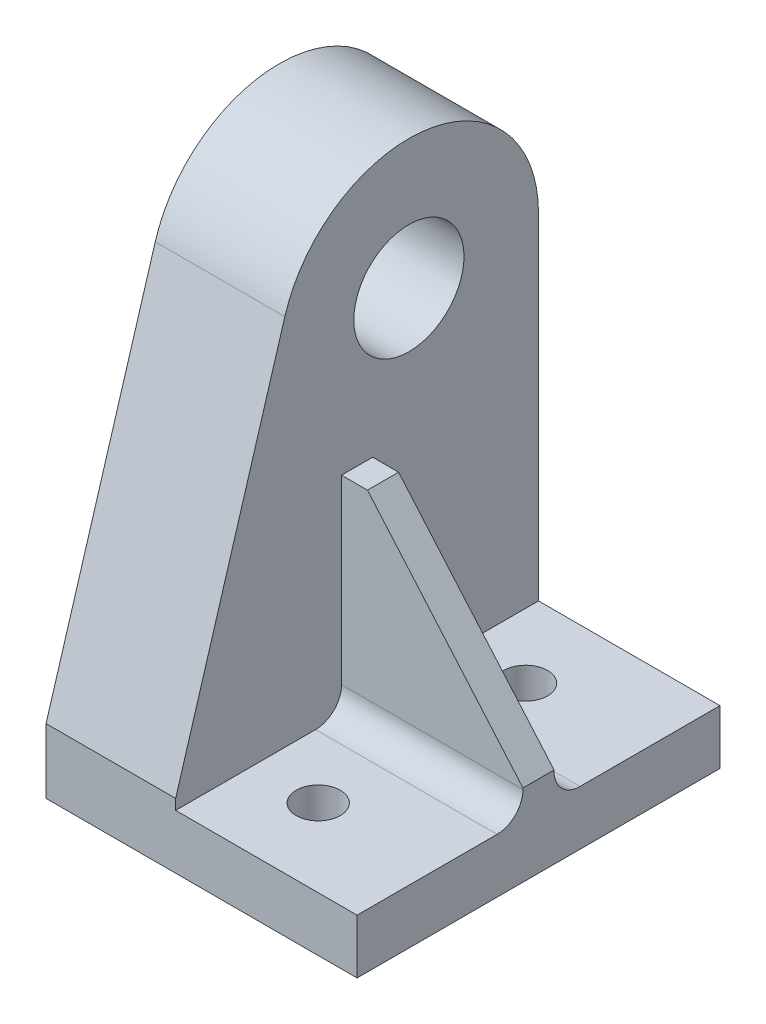
ISO-10303-21;
HEADER;
FILE_DESCRIPTION(('STEP AP214'),'2;1');
FILE_NAME('part.step','',(''),(''),'','','');
FILE_SCHEMA(('AUTOMOTIVE_DESIGN { 1 0 10303 214 1 1 1 1 }'));
ENDSEC;
DATA;
#1=APPLICATION_CONTEXT('core data for automotive mechanical design processes');
#2=APPLICATION_PROTOCOL_DEFINITION('international standard','automotive_design',2000,#1);
#3=PRODUCT_CONTEXT('',#1,'mechanical');
#4=PRODUCT('Part','Part','',(#3));
#5=PRODUCT_RELATED_PRODUCT_CATEGORY('part','',(#4));
#6=PRODUCT_DEFINITION_FORMATION('','',#4);
#7=PRODUCT_DEFINITION_CONTEXT('part definition',#1,'design');
#8=PRODUCT_DEFINITION('design','',#6,#7);
#9=PRODUCT_DEFINITION_SHAPE('','',#8);
#10=(LENGTH_UNIT() NAMED_UNIT(*) SI_UNIT(.MILLI.,.METRE.));
#11=(NAMED_UNIT(*) PLANE_ANGLE_UNIT() SI_UNIT($,.RADIAN.));
#12=(NAMED_UNIT(*) SI_UNIT($,.STERADIAN.) SOLID_ANGLE_UNIT());
#13=UNCERTAINTY_MEASURE_WITH_UNIT(LENGTH_MEASURE(1.E-05),#10,'distance_accuracy_value','');
#14=(GEOMETRIC_REPRESENTATION_CONTEXT(3) GLOBAL_UNCERTAINTY_ASSIGNED_CONTEXT((#13)) GLOBAL_UNIT_ASSIGNED_CONTEXT((#10,
#11,#12)) REPRESENTATION_CONTEXT('',''));
#15=CARTESIAN_POINT('',(0.,0.,0.));
#16=DIRECTION('',(0.,0.,1.));
#17=DIRECTION('',(1.,0.,0.));
#18=AXIS2_PLACEMENT_3D('',#15,#16,#17);
#19=CARTESIAN_POINT('',(0.,4.2,28.));
#20=DIRECTION('',(0.,-1.,0.));
#21=DIRECTION('',(1.,0.,0.));
#22=AXIS2_PLACEMENT_3D('',#19,#20,#21);
#23=PLANE('',#22);
#24=CARTESIAN_POINT('',(-9.,4.2,22.));
#25=DIRECTION('',(0.,-1.,0.));
#26=DIRECTION('',(1.,0.,0.));
#27=AXIS2_PLACEMENT_3D('',#24,#25,#26);
#28=CIRCLE('',#27,1.7);
#29=CARTESIAN_POINT('',(-7.3,4.2,22.));
#30=VERTEX_POINT('',#29);
#31=EDGE_CURVE('E193',#30,#30,#28,.F.);
#32=ORIENTED_EDGE('',*,*,#31,.F.);
#33=EDGE_LOOP('',(#32));
#34=FACE_BOUND('',#33,.T.);
#35=DIRECTION('',(0.,0.,-1.));
#36=VECTOR('',#35,1.);
#37=CARTESIAN_POINT('',(0.,4.2,28.));
#38=LINE('',#37,#36);
#39=CARTESIAN_POINT('',(0.,4.2,28.));
#40=VERTEX_POINT('',#39);
#41=CARTESIAN_POINT('',(0.,4.2,17.2));
#42=VERTEX_POINT('',#41);
#43=EDGE_CURVE('E254',#40,#42,#38,.T.);
#44=ORIENTED_EDGE('',*,*,#43,.T.);
#45=DIRECTION('',(-1.,0.,0.));
#46=VECTOR('',#45,1.);
#47=CARTESIAN_POINT('',(-14.,4.2,17.2));
#48=LINE('',#47,#46);
#49=CARTESIAN_POINT('',(-14.,4.2,17.2));
#50=VERTEX_POINT('',#49);
#51=EDGE_CURVE('E269',#42,#50,#48,.T.);
#52=ORIENTED_EDGE('',*,*,#51,.T.);
#53=DIRECTION('',(0.,0.,-1.));
#54=VECTOR('',#53,1.);
#55=CARTESIAN_POINT('',(-14.,4.2,28.));
#56=LINE('',#55,#54);
#57=CARTESIAN_POINT('',(-14.,4.2,28.));
#58=VERTEX_POINT('',#57);
#59=EDGE_CURVE('E250',#58,#50,#56,.T.);
#60=ORIENTED_EDGE('',*,*,#59,.F.);
#61=DIRECTION('',(-1.,0.,0.));
#62=VECTOR('',#61,1.);
#63=CARTESIAN_POINT('',(0.,4.2,28.));
#64=LINE('',#63,#62);
#65=EDGE_CURVE('E223',#40,#58,#64,.T.);
#66=ORIENTED_EDGE('',*,*,#65,.F.);
#67=EDGE_LOOP('',(#44,#52,#60,#66));
#68=FACE_BOUND('',#67,.T.);
#69=ADVANCED_FACE('F48',(#34,#68),#23,.F.);
#70=CARTESIAN_POINT('',(0.,4.2,28.));
#71=DIRECTION('',(-1.,0.,0.));
#72=DIRECTION('',(0.,-1.,0.));
#73=AXIS2_PLACEMENT_3D('',#70,#71,#72);
#74=PLANE('',#73);
#75=DIRECTION('',(0.,1.,0.));
#76=VECTOR('',#75,1.);
#77=CARTESIAN_POINT('',(0.,4.2,0.));
#78=LINE('',#77,#76);
#79=CARTESIAN_POINT('',(0.,0.,0.));
#80=VERTEX_POINT('',#79);
#81=CARTESIAN_POINT('',(0.,4.2,0.));
#82=VERTEX_POINT('',#81);
#83=EDGE_CURVE('E219',#80,#82,#78,.T.);
#84=ORIENTED_EDGE('',*,*,#83,.T.);
#85=CARTESIAN_POINT('',(0.,4.2,10.8));
#86=VERTEX_POINT('',#85);
#87=EDGE_CURVE('E253',#86,#82,#38,.T.);
#88=ORIENTED_EDGE('',*,*,#87,.F.);
#89=CARTESIAN_POINT('',(0.,6.2,10.8));
#90=DIRECTION('',(-1.,0.,0.));
#91=DIRECTION('',(0.,-1.,0.));
#92=AXIS2_PLACEMENT_3D('',#89,#90,#91);
#93=CIRCLE('',#92,2.);
#94=CARTESIAN_POINT('',(0.,6.2,12.8));
#95=VERTEX_POINT('',#94);
#96=EDGE_CURVE('E56',#86,#95,#93,.T.);
#97=ORIENTED_EDGE('',*,*,#96,.T.);
#98=DIRECTION('',(0.,-1.,0.));
#99=VECTOR('',#98,1.);
#100=CARTESIAN_POINT('',(0.,4.2,12.8));
#101=LINE('',#100,#99);
#102=CARTESIAN_POINT('',(0.,6.3,12.8));
#103=VERTEX_POINT('',#102);
#104=EDGE_CURVE('E186',#103,#95,#101,.T.);
#105=ORIENTED_EDGE('',*,*,#104,.F.);
#106=DIRECTION('',(0.,0.,1.));
#107=VECTOR('',#106,1.);
#108=CARTESIAN_POINT('',(0.,6.3,12.8));
#109=LINE('',#108,#107);
#110=CARTESIAN_POINT('',(0.,6.3,15.2));
#111=VERTEX_POINT('',#110);
#112=EDGE_CURVE('E171',#103,#111,#109,.T.);
#113=ORIENTED_EDGE('',*,*,#112,.T.);
#114=DIRECTION('',(0.,-1.,0.));
#115=VECTOR('',#114,1.);
#116=CARTESIAN_POINT('',(0.,4.2,15.2));
#117=LINE('',#116,#115);
#118=CARTESIAN_POINT('',(0.,6.2,15.2));
#119=VERTEX_POINT('',#118);
#120=EDGE_CURVE('E180',#111,#119,#117,.T.);
#121=ORIENTED_EDGE('',*,*,#120,.T.);
#122=CARTESIAN_POINT('',(0.,6.2,17.2));
#123=DIRECTION('',(-1.,0.,0.));
#124=DIRECTION('',(0.,-1.,0.));
#125=AXIS2_PLACEMENT_3D('',#122,#123,#124);
#126=CIRCLE('',#125,2.);
#127=EDGE_CURVE('E13',#119,#42,#126,.T.);
#128=ORIENTED_EDGE('',*,*,#127,.T.);
#129=ORIENTED_EDGE('',*,*,#43,.F.);
#130=DIRECTION('',(0.,1.,0.));
#131=VECTOR('',#130,1.);
#132=CARTESIAN_POINT('',(0.,4.2,28.));
#133=LINE('',#132,#131);
#134=CARTESIAN_POINT('',(0.,0.,28.));
#135=VERTEX_POINT('',#134);
#136=EDGE_CURVE('E220',#135,#40,#133,.T.);
#137=ORIENTED_EDGE('',*,*,#136,.F.);
#138=DIRECTION('',(0.,0.,-1.));
#139=VECTOR('',#138,1.);
#140=CARTESIAN_POINT('',(0.,0.,28.));
#141=LINE('',#140,#139);
#142=EDGE_CURVE('E233',#135,#80,#141,.T.);
#143=ORIENTED_EDGE('',*,*,#142,.T.);
#144=EDGE_LOOP('',(#84,#88,#97,#105,#113,#121,#128,#129,#137,#143));
#145=FACE_BOUND('',#144,.T.);
#146=ADVANCED_FACE('F274',(#145),#74,.F.);
#147=CARTESIAN_POINT('',(-9.,4.2,6.));
#148=DIRECTION('',(0.,-1.,0.));
#149=DIRECTION('',(1.,0.,0.));
#150=AXIS2_PLACEMENT_3D('',#147,#148,#149);
#151=CIRCLE('',#150,1.7);
#152=CARTESIAN_POINT('',(-7.3,4.2,6.));
#153=VERTEX_POINT('',#152);
#154=EDGE_CURVE('E194',#153,#153,#151,.F.);
#155=ORIENTED_EDGE('',*,*,#154,.F.);
#156=EDGE_LOOP('',(#155));
#157=FACE_BOUND('',#156,.T.);
#158=CARTESIAN_POINT('',(-14.,4.2,10.8));
#159=VERTEX_POINT('',#158);
#160=CARTESIAN_POINT('',(-14.,4.2,0.));
#161=VERTEX_POINT('',#160);
#162=EDGE_CURVE('E249',#159,#161,#56,.T.);
#163=ORIENTED_EDGE('',*,*,#162,.F.);
#164=DIRECTION('',(-1.,0.,0.));
#165=VECTOR('',#164,1.);
#166=CARTESIAN_POINT('',(0.,4.2,10.8));
#167=LINE('',#166,#165);
#168=EDGE_CURVE('E267',#159,#86,#167,.F.);
#169=ORIENTED_EDGE('',*,*,#168,.T.);
#170=ORIENTED_EDGE('',*,*,#87,.T.);
#171=DIRECTION('',(-1.,0.,0.));
#172=VECTOR('',#171,1.);
#173=CARTESIAN_POINT('',(0.,4.2,0.));
#174=LINE('',#173,#172);
#175=EDGE_CURVE('E236',#82,#161,#174,.T.);
#176=ORIENTED_EDGE('',*,*,#175,.T.);
#177=EDGE_LOOP('',(#163,#169,#170,#176));
#178=FACE_BOUND('',#177,.T.);
#179=ADVANCED_FACE('F284',(#157,#178),#23,.F.);
#180=CARTESIAN_POINT('',(-14.,4.2,28.));
#181=DIRECTION('',(-1.,0.,0.));
#182=DIRECTION('',(0.,0.,1.));
#183=AXIS2_PLACEMENT_3D('',#180,#181,#182);
#184=PLANE('',#183);
#185=CARTESIAN_POINT('',(-14.,30.1,10.));
#186=DIRECTION('',(-1.,0.,0.));
#187=DIRECTION('',(0.,0.,1.));
#188=AXIS2_PLACEMENT_3D('',#185,#186,#187);
#189=CIRCLE('',#188,4.25);
#190=CARTESIAN_POINT('',(-14.,30.1,14.25));
#191=VERTEX_POINT('',#190);
#192=EDGE_CURVE('E216',#191,#191,#189,.T.);
#193=ORIENTED_EDGE('',*,*,#192,.T.);
#194=EDGE_LOOP('',(#193));
#195=FACE_BOUND('',#194,.T.);
#196=DIRECTION('',(0.,1.,0.));
#197=VECTOR('',#196,1.);
#198=CARTESIAN_POINT('',(-14.,4.2,12.8));
#199=LINE('',#198,#197);
#200=CARTESIAN_POINT('',(-14.,6.2,12.8));
#201=VERTEX_POINT('',#200);
#202=CARTESIAN_POINT('',(-14.,20.2,12.8));
#203=VERTEX_POINT('',#202);
#204=EDGE_CURVE('E158',#201,#203,#199,.T.);
#205=ORIENTED_EDGE('',*,*,#204,.F.);
#206=CARTESIAN_POINT('',(-14.,6.2,10.8));
#207=DIRECTION('',(-1.,0.,0.));
#208=DIRECTION('',(0.,0.,1.));
#209=AXIS2_PLACEMENT_3D('',#206,#207,#208);
#210=CIRCLE('',#209,2.);
#211=EDGE_CURVE('E265',#201,#159,#210,.F.);
#212=ORIENTED_EDGE('',*,*,#211,.T.);
#213=ORIENTED_EDGE('',*,*,#162,.T.);
#214=DIRECTION('',(0.,1.,0.));
#215=VECTOR('',#214,1.);
#216=CARTESIAN_POINT('',(-14.,4.2,0.));
#217=LINE('',#216,#215);
#218=CARTESIAN_POINT('',(-14.,30.1,0.));
#219=VERTEX_POINT('',#218);
#220=EDGE_CURVE('E239',#161,#219,#217,.T.);
#221=ORIENTED_EDGE('',*,*,#220,.T.);
#222=CARTESIAN_POINT('',(-14.,30.1,10.));
#223=DIRECTION('',(-1.,0.,0.));
#224=DIRECTION('',(0.,0.,1.));
#225=AXIS2_PLACEMENT_3D('',#222,#223,#224);
#226=CIRCLE('',#225,10.);
#227=CARTESIAN_POINT('',(-14.,32.9828009223265,19.5754612861331));
#228=VERTEX_POINT('',#227);
#229=EDGE_CURVE('E211',#219,#228,#226,.F.);
#230=ORIENTED_EDGE('',*,*,#229,.T.);
#231=DIRECTION('',(0.,-0.957546128613308,0.288280092232651));
#232=VECTOR('',#231,1.);
#233=CARTESIAN_POINT('',(-14.,4.26648432926213,28.2208331890189));
#234=LINE('',#233,#232);
#235=CARTESIAN_POINT('',(-14.,5.,28.));
#236=VERTEX_POINT('',#235);
#237=EDGE_CURVE('E213',#228,#236,#234,.T.);
#238=ORIENTED_EDGE('',*,*,#237,.T.);
#239=DIRECTION('',(0.,1.,0.));
#240=VECTOR('',#239,1.);
#241=CARTESIAN_POINT('',(-14.,4.2,28.));
#242=LINE('',#241,#240);
#243=EDGE_CURVE('E226',#58,#236,#242,.T.);
#244=ORIENTED_EDGE('',*,*,#243,.F.);
#245=ORIENTED_EDGE('',*,*,#59,.T.);
#246=CARTESIAN_POINT('',(-14.,6.2,17.2));
#247=DIRECTION('',(-1.,0.,0.));
#248=DIRECTION('',(0.,0.,1.));
#249=AXIS2_PLACEMENT_3D('',#246,#247,#248);
#250=CIRCLE('',#249,2.);
#251=CARTESIAN_POINT('',(-14.,6.2,15.2));
#252=VERTEX_POINT('',#251);
#253=EDGE_CURVE('E263',#50,#252,#250,.F.);
#254=ORIENTED_EDGE('',*,*,#253,.T.);
#255=DIRECTION('',(0.,1.,0.));
#256=VECTOR('',#255,1.);
#257=CARTESIAN_POINT('',(-14.,4.2,15.2));
#258=LINE('',#257,#256);
#259=CARTESIAN_POINT('',(-14.,20.2,15.2));
#260=VERTEX_POINT('',#259);
#261=EDGE_CURVE('E182',#252,#260,#258,.T.);
#262=ORIENTED_EDGE('',*,*,#261,.T.);
#263=DIRECTION('',(0.,0.,1.));
#264=VECTOR('',#263,1.);
#265=CARTESIAN_POINT('',(-14.,20.2,12.8));
#266=LINE('',#265,#264);
#267=EDGE_CURVE('E170',#203,#260,#266,.T.);
#268=ORIENTED_EDGE('',*,*,#267,.F.);
#269=EDGE_LOOP('',(#205,#212,#213,#221,#230,#238,#244,#245,#254,#262,#268));
#270=FACE_BOUND('',#269,.T.);
#271=ADVANCED_FACE('F282',(#195,#270),#184,.F.);
#272=CARTESIAN_POINT('',(-24.,40.1,28.));
#273=DIRECTION('',(1.,0.,0.));
#274=DIRECTION('',(0.,1.,0.));
#275=AXIS2_PLACEMENT_3D('',#272,#273,#274);
#276=PLANE('',#275);
#277=CARTESIAN_POINT('',(-24.,30.1,10.));
#278=DIRECTION('',(-1.,0.,0.));
#279=DIRECTION('',(0.,-1.,0.));
#280=AXIS2_PLACEMENT_3D('',#277,#278,#279);
#281=CIRCLE('',#280,4.25);
#282=CARTESIAN_POINT('',(-24.,25.85,10.));
#283=VERTEX_POINT('',#282);
#284=EDGE_CURVE('E197',#283,#283,#281,.T.);
#285=ORIENTED_EDGE('',*,*,#284,.F.);
#286=EDGE_LOOP('',(#285));
#287=FACE_BOUND('',#286,.T.);
#288=DIRECTION('',(0.,-1.,0.));
#289=VECTOR('',#288,1.);
#290=CARTESIAN_POINT('',(-24.,40.1,28.));
#291=LINE('',#290,#289);
#292=CARTESIAN_POINT('',(-24.,5.,28.));
#293=VERTEX_POINT('',#292);
#294=CARTESIAN_POINT('',(-24.,0.,28.));
#295=VERTEX_POINT('',#294);
#296=EDGE_CURVE('E229',#293,#295,#291,.T.);
#297=ORIENTED_EDGE('',*,*,#296,.F.);
#298=DIRECTION('',(0.,-0.957546128613308,0.288280092232651));
#299=VECTOR('',#298,1.);
#300=CARTESIAN_POINT('',(-24.,5.,28.));
#301=LINE('',#300,#299);
#302=CARTESIAN_POINT('',(-24.,32.9828009223265,19.5754612861331));
#303=VERTEX_POINT('',#302);
#304=EDGE_CURVE('E206',#303,#293,#301,.T.);
#305=ORIENTED_EDGE('',*,*,#304,.F.);
#306=CARTESIAN_POINT('',(-24.,30.1,10.));
#307=DIRECTION('',(1.,0.,0.));
#308=DIRECTION('',(0.,-1.,0.));
#309=AXIS2_PLACEMENT_3D('',#306,#307,#308);
#310=CIRCLE('',#309,10.);
#311=CARTESIAN_POINT('',(-24.,30.1,0.));
#312=VERTEX_POINT('',#311);
#313=EDGE_CURVE('E204',#312,#303,#310,.T.);
#314=ORIENTED_EDGE('',*,*,#313,.F.);
#315=DIRECTION('',(0.,-1.,0.));
#316=VECTOR('',#315,1.);
#317=CARTESIAN_POINT('',(-24.,40.1,0.));
#318=LINE('',#317,#316);
#319=CARTESIAN_POINT('',(-24.,0.,0.));
#320=VERTEX_POINT('',#319);
#321=EDGE_CURVE('E241',#312,#320,#318,.T.);
#322=ORIENTED_EDGE('',*,*,#321,.T.);
#323=DIRECTION('',(0.,0.,-1.));
#324=VECTOR('',#323,1.);
#325=CARTESIAN_POINT('',(-24.,0.,28.));
#326=LINE('',#325,#324);
#327=EDGE_CURVE('E246',#295,#320,#326,.T.);
#328=ORIENTED_EDGE('',*,*,#327,.F.);
#329=EDGE_LOOP('',(#297,#305,#314,#322,#328));
#330=FACE_BOUND('',#329,.T.);
#331=ADVANCED_FACE('F304',(#287,#330),#276,.F.);
#332=CARTESIAN_POINT('',(-24.,0.,28.));
#333=DIRECTION('',(0.,1.,0.));
#334=DIRECTION('',(0.,0.,1.));
#335=AXIS2_PLACEMENT_3D('',#332,#333,#334);
#336=PLANE('',#335);
#337=CARTESIAN_POINT('',(-9.,0.,22.));
#338=DIRECTION('',(0.,-1.,0.));
#339=DIRECTION('',(0.,0.,-1.));
#340=AXIS2_PLACEMENT_3D('',#337,#338,#339);
#341=CIRCLE('',#340,1.7);
#342=CARTESIAN_POINT('',(-9.,0.,20.3));
#343=VERTEX_POINT('',#342);
#344=EDGE_CURVE('E190',#343,#343,#341,.T.);
#345=ORIENTED_EDGE('',*,*,#344,.F.);
#346=EDGE_LOOP('',(#345));
#347=FACE_BOUND('',#346,.T.);
#348=CARTESIAN_POINT('',(-9.,0.,6.));
#349=DIRECTION('',(0.,-1.,0.));
#350=DIRECTION('',(0.,0.,-1.));
#351=AXIS2_PLACEMENT_3D('',#348,#349,#350);
#352=CIRCLE('',#351,1.7);
#353=CARTESIAN_POINT('',(-9.,0.,4.3));
#354=VERTEX_POINT('',#353);
#355=EDGE_CURVE('E189',#354,#354,#352,.T.);
#356=ORIENTED_EDGE('',*,*,#355,.F.);
#357=EDGE_LOOP('',(#356));
#358=FACE_BOUND('',#357,.T.);
#359=DIRECTION('',(1.,0.,0.));
#360=VECTOR('',#359,1.);
#361=CARTESIAN_POINT('',(-24.,0.,0.));
#362=LINE('',#361,#360);
#363=EDGE_CURVE('E224',#320,#80,#362,.T.);
#364=ORIENTED_EDGE('',*,*,#363,.T.);
#365=ORIENTED_EDGE('',*,*,#142,.F.);
#366=DIRECTION('',(1.,0.,0.));
#367=VECTOR('',#366,1.);
#368=CARTESIAN_POINT('',(-24.,0.,28.));
#369=LINE('',#368,#367);
#370=EDGE_CURVE('E231',#295,#135,#369,.T.);
#371=ORIENTED_EDGE('',*,*,#370,.F.);
#372=ORIENTED_EDGE('',*,*,#327,.T.);
#373=EDGE_LOOP('',(#364,#365,#371,#372));
#374=FACE_BOUND('',#373,.T.);
#375=ADVANCED_FACE('F359',(#347,#358,#374),#336,.F.);
#376=CARTESIAN_POINT('',(0.,0.,28.));
#377=DIRECTION('',(0.,0.,1.));
#378=DIRECTION('',(1.,0.,0.));
#379=AXIS2_PLACEMENT_3D('',#376,#377,#378);
#380=PLANE('',#379);
#381=DIRECTION('',(1.,0.,0.));
#382=VECTOR('',#381,1.);
#383=CARTESIAN_POINT('',(0.,5.,28.));
#384=LINE('',#383,#382);
#385=EDGE_CURVE('E259',#293,#236,#384,.T.);
#386=ORIENTED_EDGE('',*,*,#385,.F.);
#387=ORIENTED_EDGE('',*,*,#296,.T.);
#388=ORIENTED_EDGE('',*,*,#370,.T.);
#389=ORIENTED_EDGE('',*,*,#136,.T.);
#390=ORIENTED_EDGE('',*,*,#65,.T.);
#391=ORIENTED_EDGE('',*,*,#243,.T.);
#392=EDGE_LOOP('',(#386,#387,#388,#389,#390,#391));
#393=FACE_BOUND('',#392,.T.);
#394=ADVANCED_FACE('F308',(#393),#380,.T.);
#395=CARTESIAN_POINT('',(0.,0.,0.));
#396=DIRECTION('',(0.,0.,1.));
#397=DIRECTION('',(1.,0.,0.));
#398=AXIS2_PLACEMENT_3D('',#395,#396,#397);
#399=PLANE('',#398);
#400=ORIENTED_EDGE('',*,*,#363,.F.);
#401=ORIENTED_EDGE('',*,*,#321,.F.);
#402=DIRECTION('',(-1.,0.,0.));
#403=VECTOR('',#402,1.);
#404=CARTESIAN_POINT('',(0.,30.1,0.));
#405=LINE('',#404,#403);
#406=EDGE_CURVE('E256',#312,#219,#405,.F.);
#407=ORIENTED_EDGE('',*,*,#406,.T.);
#408=ORIENTED_EDGE('',*,*,#220,.F.);
#409=ORIENTED_EDGE('',*,*,#175,.F.);
#410=ORIENTED_EDGE('',*,*,#83,.F.);
#411=EDGE_LOOP('',(#400,#401,#407,#408,#409,#410));
#412=FACE_BOUND('',#411,.T.);
#413=ADVANCED_FACE('F290',(#412),#399,.F.);
#414=CARTESIAN_POINT('',(0.,5.,28.));
#415=DIRECTION('',(0.,-0.288280092232651,-0.957546128613308));
#416=DIRECTION('',(0.,0.957546128613308,-0.288280092232651));
#417=AXIS2_PLACEMENT_3D('',#414,#415,#416);
#418=PLANE('',#417);
#419=DIRECTION('',(-1.,0.,0.));
#420=VECTOR('',#419,1.);
#421=CARTESIAN_POINT('',(0.,32.9828009223265,19.5754612861331));
#422=LINE('',#421,#420);
#423=EDGE_CURVE('E208',#228,#303,#422,.T.);
#424=ORIENTED_EDGE('',*,*,#423,.T.);
#425=ORIENTED_EDGE('',*,*,#304,.T.);
#426=ORIENTED_EDGE('',*,*,#385,.T.);
#427=ORIENTED_EDGE('',*,*,#237,.F.);
#428=EDGE_LOOP('',(#424,#425,#426,#427));
#429=FACE_BOUND('',#428,.T.);
#430=ADVANCED_FACE('F300',(#429),#418,.F.);
#431=CARTESIAN_POINT('',(0.,30.1,10.));
#432=DIRECTION('',(-1.,0.,0.));
#433=DIRECTION('',(0.,-1.,0.));
#434=AXIS2_PLACEMENT_3D('',#431,#432,#433);
#435=CYLINDRICAL_SURFACE('',#434,10.);
#436=ORIENTED_EDGE('',*,*,#406,.F.);
#437=ORIENTED_EDGE('',*,*,#313,.T.);
#438=ORIENTED_EDGE('',*,*,#423,.F.);
#439=ORIENTED_EDGE('',*,*,#229,.F.);
#440=EDGE_LOOP('',(#436,#437,#438,#439));
#441=FACE_BOUND('',#440,.T.);
#442=ADVANCED_FACE('F296',(#441),#435,.T.);
#443=CARTESIAN_POINT('',(0.,30.1,10.));
#444=DIRECTION('',(-1.,0.,0.));
#445=DIRECTION('',(0.,-1.,0.));
#446=AXIS2_PLACEMENT_3D('',#443,#444,#445);
#447=CYLINDRICAL_SURFACE('',#446,4.25);
#448=ORIENTED_EDGE('',*,*,#284,.T.);
#449=EDGE_LOOP('',(#448));
#450=FACE_BOUND('',#449,.T.);
#451=ORIENTED_EDGE('',*,*,#192,.F.);
#452=EDGE_LOOP('',(#451));
#453=FACE_BOUND('',#452,.T.);
#454=ADVANCED_FACE('F340',(#450,#453),#447,.F.);
#455=CARTESIAN_POINT('',(-9.,40.101,6.));
#456=DIRECTION('',(0.,-1.,0.));
#457=DIRECTION('',(0.,0.,-1.));
#458=AXIS2_PLACEMENT_3D('',#455,#456,#457);
#459=CYLINDRICAL_SURFACE('',#458,1.7);
#460=ORIENTED_EDGE('',*,*,#355,.T.);
#461=EDGE_LOOP('',(#460));
#462=FACE_BOUND('',#461,.T.);
#463=ORIENTED_EDGE('',*,*,#154,.T.);
#464=EDGE_LOOP('',(#463));
#465=FACE_BOUND('',#464,.T.);
#466=ADVANCED_FACE('F337',(#462,#465),#459,.F.);
#467=CARTESIAN_POINT('',(-9.,40.101,22.));
#468=DIRECTION('',(0.,-1.,0.));
#469=DIRECTION('',(0.,0.,-1.));
#470=AXIS2_PLACEMENT_3D('',#467,#468,#469);
#471=CYLINDRICAL_SURFACE('',#470,1.7);
#472=ORIENTED_EDGE('',*,*,#344,.T.);
#473=EDGE_LOOP('',(#472));
#474=FACE_BOUND('',#473,.T.);
#475=ORIENTED_EDGE('',*,*,#31,.T.);
#476=EDGE_LOOP('',(#475));
#477=FACE_BOUND('',#476,.T.);
#478=ADVANCED_FACE('F339',(#474,#477),#471,.F.);
#479=CARTESIAN_POINT('',(-14.,20.2,12.8));
#480=DIRECTION('',(0.,-1.,0.));
#481=DIRECTION('',(0.,0.,-1.));
#482=AXIS2_PLACEMENT_3D('',#479,#480,#481);
#483=PLANE('',#482);
#484=DIRECTION('',(1.,0.,0.));
#485=VECTOR('',#484,1.);
#486=CARTESIAN_POINT('',(-14.,20.2,15.2));
#487=LINE('',#486,#485);
#488=CARTESIAN_POINT('',(-12.,20.2,15.2));
#489=VERTEX_POINT('',#488);
#490=EDGE_CURVE('E167',#260,#489,#487,.T.);
#491=ORIENTED_EDGE('',*,*,#490,.T.);
#492=DIRECTION('',(0.,0.,1.));
#493=VECTOR('',#492,1.);
#494=CARTESIAN_POINT('',(-12.,20.2,12.8));
#495=LINE('',#494,#493);
#496=CARTESIAN_POINT('',(-12.,20.2,12.8));
#497=VERTEX_POINT('',#496);
#498=EDGE_CURVE('E164',#497,#489,#495,.T.);
#499=ORIENTED_EDGE('',*,*,#498,.F.);
#500=DIRECTION('',(1.,0.,0.));
#501=VECTOR('',#500,1.);
#502=CARTESIAN_POINT('',(-14.,20.2,12.8));
#503=LINE('',#502,#501);
#504=EDGE_CURVE('E149',#203,#497,#503,.T.);
#505=ORIENTED_EDGE('',*,*,#504,.F.);
#506=ORIENTED_EDGE('',*,*,#267,.T.);
#507=EDGE_LOOP('',(#491,#499,#505,#506));
#508=FACE_BOUND('',#507,.T.);
#509=ADVANCED_FACE('F165',(#508),#483,.F.);
#510=CARTESIAN_POINT('',(-12.,20.2,12.8));
#511=DIRECTION('',(-0.756945441071661,-0.653478078623016,0.));
#512=DIRECTION('',(0.653478078623016,-0.756945441071661,0.));
#513=AXIS2_PLACEMENT_3D('',#510,#511,#512);
#514=PLANE('',#513);
#515=DIRECTION('',(0.653478078623016,-0.756945441071661,0.));
#516=VECTOR('',#515,1.);
#517=CARTESIAN_POINT('',(-12.,20.2,15.2));
#518=LINE('',#517,#516);
#519=EDGE_CURVE('E185',#489,#111,#518,.T.);
#520=ORIENTED_EDGE('',*,*,#519,.T.);
#521=ORIENTED_EDGE('',*,*,#112,.F.);
#522=DIRECTION('',(0.653478078623016,-0.756945441071661,0.));
#523=VECTOR('',#522,1.);
#524=CARTESIAN_POINT('',(-12.,20.2,12.8));
#525=LINE('',#524,#523);
#526=EDGE_CURVE('E154',#497,#103,#525,.T.);
#527=ORIENTED_EDGE('',*,*,#526,.F.);
#528=ORIENTED_EDGE('',*,*,#498,.T.);
#529=EDGE_LOOP('',(#520,#521,#527,#528));
#530=FACE_BOUND('',#529,.T.);
#531=ADVANCED_FACE('F173',(#530),#514,.F.);
#532=CARTESIAN_POINT('',(0.,0.,12.8));
#533=DIRECTION('',(0.,0.,-1.));
#534=DIRECTION('',(-1.,0.,0.));
#535=AXIS2_PLACEMENT_3D('',#532,#533,#534);
#536=PLANE('',#535);
#537=ORIENTED_EDGE('',*,*,#104,.T.);
#538=DIRECTION('',(-1.,0.,0.));
#539=VECTOR('',#538,1.);
#540=CARTESIAN_POINT('',(0.,6.2,12.8));
#541=LINE('',#540,#539);
#542=EDGE_CURVE('E261',#95,#201,#541,.T.);
#543=ORIENTED_EDGE('',*,*,#542,.T.);
#544=ORIENTED_EDGE('',*,*,#204,.T.);
#545=ORIENTED_EDGE('',*,*,#504,.T.);
#546=ORIENTED_EDGE('',*,*,#526,.T.);
#547=EDGE_LOOP('',(#537,#543,#544,#545,#546));
#548=FACE_BOUND('',#547,.T.);
#549=ADVANCED_FACE('F152',(#548),#536,.T.);
#550=CARTESIAN_POINT('',(0.,0.,15.2));
#551=DIRECTION('',(0.,0.,-1.));
#552=DIRECTION('',(-1.,0.,0.));
#553=AXIS2_PLACEMENT_3D('',#550,#551,#552);
#554=PLANE('',#553);
#555=ORIENTED_EDGE('',*,*,#261,.F.);
#556=DIRECTION('',(-1.,0.,0.));
#557=VECTOR('',#556,1.);
#558=CARTESIAN_POINT('',(0.,6.2,15.2));
#559=LINE('',#558,#557);
#560=EDGE_CURVE('E63',#252,#119,#559,.F.);
#561=ORIENTED_EDGE('',*,*,#560,.T.);
#562=ORIENTED_EDGE('',*,*,#120,.F.);
#563=ORIENTED_EDGE('',*,*,#519,.F.);
#564=ORIENTED_EDGE('',*,*,#490,.F.);
#565=EDGE_LOOP('',(#555,#561,#562,#563,#564));
#566=FACE_BOUND('',#565,.T.);
#567=ADVANCED_FACE('F319',(#566),#554,.F.);
#568=CARTESIAN_POINT('',(0.,6.2,10.8));
#569=DIRECTION('',(-1.,0.,0.));
#570=DIRECTION('',(0.,-1.,0.));
#571=AXIS2_PLACEMENT_3D('',#568,#569,#570);
#572=CYLINDRICAL_SURFACE('',#571,2.);
#573=ORIENTED_EDGE('',*,*,#96,.F.);
#574=ORIENTED_EDGE('',*,*,#168,.F.);
#575=ORIENTED_EDGE('',*,*,#211,.F.);
#576=ORIENTED_EDGE('',*,*,#542,.F.);
#577=EDGE_LOOP('',(#573,#574,#575,#576));
#578=FACE_BOUND('',#577,.T.);
#579=ADVANCED_FACE('F279',(#578),#572,.F.);
#580=CARTESIAN_POINT('',(0.,6.2,17.2));
#581=DIRECTION('',(1.,0.,0.));
#582=DIRECTION('',(0.,1.,0.));
#583=AXIS2_PLACEMENT_3D('',#580,#581,#582);
#584=CYLINDRICAL_SURFACE('',#583,2.);
#585=ORIENTED_EDGE('',*,*,#127,.F.);
#586=ORIENTED_EDGE('',*,*,#560,.F.);
#587=ORIENTED_EDGE('',*,*,#253,.F.);
#588=ORIENTED_EDGE('',*,*,#51,.F.);
#589=EDGE_LOOP('',(#585,#586,#587,#588));
#590=FACE_BOUND('',#589,.T.);
#591=ADVANCED_FACE('F50',(#590),#584,.F.);
#592=CLOSED_SHELL('',(#69,#146,#179,#271,#331,#375,#394,#413,#430,#442,#454,#466,#478,#509,#531,
#549,#567,#579,#591));
#593=MANIFOLD_SOLID_BREP('B2',#592);
#594=ADVANCED_BREP_SHAPE_REPRESENTATION('',(#18,#593),#14);
#595=SHAPE_DEFINITION_REPRESENTATION(#9,#594);
ENDSEC;
END-ISO-10303-21;
